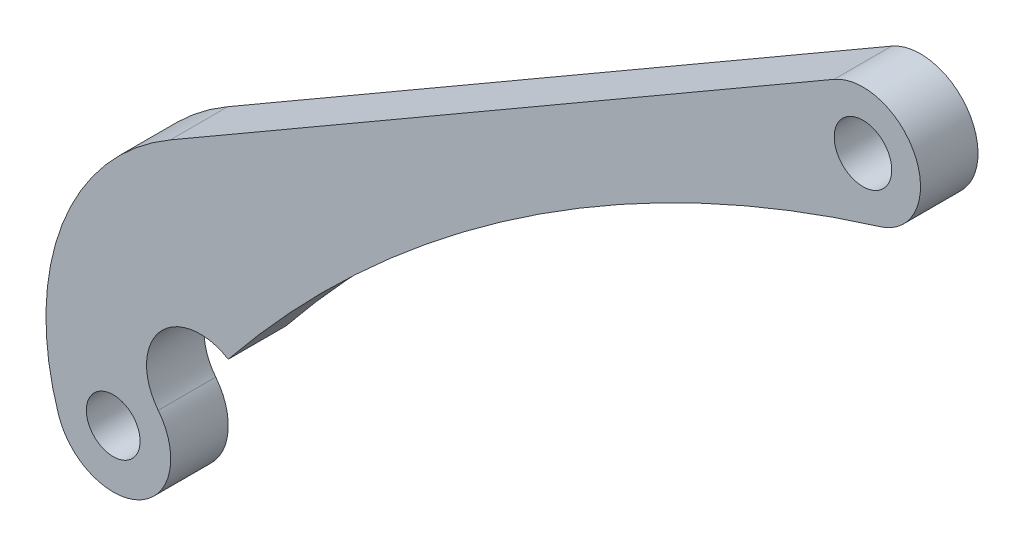
ISO-10303-21;
HEADER;
FILE_DESCRIPTION(('STEP AP214'),'2;1');
FILE_NAME('part.step','',(''),(''),'','','');
FILE_SCHEMA(('AUTOMOTIVE_DESIGN { 1 0 10303 214 1 1 1 1 }'));
ENDSEC;
DATA;
#1=APPLICATION_CONTEXT('core data for automotive mechanical design processes');
#2=APPLICATION_PROTOCOL_DEFINITION('international standard','automotive_design',2000,#1);
#3=PRODUCT_CONTEXT('',#1,'mechanical');
#4=PRODUCT('Part','Part','',(#3));
#5=PRODUCT_RELATED_PRODUCT_CATEGORY('part','',(#4));
#6=PRODUCT_DEFINITION_FORMATION('','',#4);
#7=PRODUCT_DEFINITION_CONTEXT('part definition',#1,'design');
#8=PRODUCT_DEFINITION('design','',#6,#7);
#9=PRODUCT_DEFINITION_SHAPE('','',#8);
#10=(LENGTH_UNIT() NAMED_UNIT(*) SI_UNIT(.MILLI.,.METRE.));
#11=(NAMED_UNIT(*) PLANE_ANGLE_UNIT() SI_UNIT($,.RADIAN.));
#12=(NAMED_UNIT(*) SI_UNIT($,.STERADIAN.) SOLID_ANGLE_UNIT());
#13=UNCERTAINTY_MEASURE_WITH_UNIT(LENGTH_MEASURE(1.E-05),#10,'distance_accuracy_value','');
#14=(GEOMETRIC_REPRESENTATION_CONTEXT(3) GLOBAL_UNCERTAINTY_ASSIGNED_CONTEXT((#13)) GLOBAL_UNIT_ASSIGNED_CONTEXT((#10,
#11,#12)) REPRESENTATION_CONTEXT('',''));
#15=CARTESIAN_POINT('',(0.,0.,0.));
#16=DIRECTION('',(0.,0.,1.));
#17=DIRECTION('',(1.,0.,0.));
#18=AXIS2_PLACEMENT_3D('',#15,#16,#17);
#19=CARTESIAN_POINT('',(-66.3099676028184,240.059967602818,7.5));
#20=DIRECTION('',(0.,0.,-1.));
#21=DIRECTION('',(-1.,0.,0.));
#22=AXIS2_PLACEMENT_3D('',#19,#20,#21);
#23=PLANE('',#22);
#24=CARTESIAN_POINT('',(-66.3099676028184,240.059967602818,7.5));
#25=DIRECTION('',(0.,0.,-1.));
#26=DIRECTION('',(-1.,0.,0.));
#27=AXIS2_PLACEMENT_3D('',#24,#25,#26);
#28=CIRCLE('',#27,14.);
#29=CARTESIAN_POINT('',(-77.2637763462854,231.341362553182,7.5));
#30=VERTEX_POINT('',#29);
#31=CARTESIAN_POINT('',(-59.,252.,7.5));
#32=VERTEX_POINT('',#31);
#33=EDGE_CURVE('E135',#30,#32,#28,.T.);
#34=ORIENTED_EDGE('',*,*,#33,.T.);
#35=CARTESIAN_POINT('',(213.405086368704,32.2376990463132,7.5));
#36=DIRECTION('',(0.,0.,-1.));
#37=DIRECTION('',(-1.,0.,0.));
#38=AXIS2_PLACEMENT_3D('',#35,#36,#37);
#39=CIRCLE('',#38,350.);
#40=CARTESIAN_POINT('',(110.433237586368,366.74748718165,7.5));
#41=VERTEX_POINT('',#40);
#42=EDGE_CURVE('E93',#32,#41,#39,.T.);
#43=ORIENTED_EDGE('',*,*,#42,.T.);
#44=CARTESIAN_POINT('',(106.485443860573,381.218662831837,7.5));
#45=DIRECTION('',(0.,0.,1.));
#46=DIRECTION('',(-1.,0.,0.));
#47=AXIS2_PLACEMENT_3D('',#44,#45,#46);
#48=CIRCLE('',#47,15.);
#49=CARTESIAN_POINT('',(98.9690926695505,394.199589793083,7.5));
#50=VERTEX_POINT('',#49);
#51=EDGE_CURVE('E106',#41,#50,#48,.T.);
#52=ORIENTED_EDGE('',*,*,#51,.T.);
#53=DIRECTION('',(-0.865395130749759,-0.501090079401506,0.));
#54=VECTOR('',#53,1.);
#55=CARTESIAN_POINT('',(-74.1099334804013,293.981573912782,7.5));
#56=LINE('',#55,#54);
#57=CARTESIAN_POINT('',(-74.1099334804012,293.981573912782,7.5));
#58=VERTEX_POINT('',#57);
#59=EDGE_CURVE('E100',#50,#58,#56,.T.);
#60=ORIENTED_EDGE('',*,*,#59,.T.);
#61=CARTESIAN_POINT('',(-41.5390783193033,237.730890414048,7.5));
#62=DIRECTION('',(0.,0.,1.));
#63=DIRECTION('',(-1.,0.,0.));
#64=AXIS2_PLACEMENT_3D('',#61,#62,#63);
#65=CIRCLE('',#64,65.);
#66=CARTESIAN_POINT('',(-103.238276504209,217.280732875786,7.5));
#67=VERTEX_POINT('',#66);
#68=EDGE_CURVE('E104',#58,#67,#65,.T.);
#69=ORIENTED_EDGE('',*,*,#68,.T.);
#70=CARTESIAN_POINT('',(-89.,222.,7.5));
#71=DIRECTION('',(0.,0.,1.));
#72=DIRECTION('',(1.,0.,0.));
#73=AXIS2_PLACEMENT_3D('',#70,#71,#72);
#74=CIRCLE('',#73,15.);
#75=EDGE_CURVE('E56',#67,#30,#74,.T.);
#76=ORIENTED_EDGE('',*,*,#75,.T.);
#77=EDGE_LOOP('',(#34,#43,#52,#60,#69,#76));
#78=FACE_BOUND('',#77,.T.);
#79=CARTESIAN_POINT('',(-89.,222.,7.5));
#80=DIRECTION('',(0.,0.,1.));
#81=DIRECTION('',(1.,0.,0.));
#82=AXIS2_PLACEMENT_3D('',#79,#80,#81);
#83=CIRCLE('',#82,7.);
#84=CARTESIAN_POINT('',(-82.,222.,7.5));
#85=VERTEX_POINT('',#84);
#86=EDGE_CURVE('E128',#85,#85,#83,.T.);
#87=ORIENTED_EDGE('',*,*,#86,.F.);
#88=EDGE_LOOP('',(#87));
#89=FACE_BOUND('',#88,.T.);
#90=CARTESIAN_POINT('',(106.485443860573,381.218662831837,7.5));
#91=DIRECTION('',(0.,0.,1.));
#92=DIRECTION('',(1.,0.,0.));
#93=AXIS2_PLACEMENT_3D('',#90,#91,#92);
#94=CIRCLE('',#93,7.50000000000001);
#95=CARTESIAN_POINT('',(113.985443860573,381.218662831837,7.5));
#96=VERTEX_POINT('',#95);
#97=EDGE_CURVE('E179',#96,#96,#94,.T.);
#98=ORIENTED_EDGE('',*,*,#97,.F.);
#99=EDGE_LOOP('',(#98));
#100=FACE_BOUND('',#99,.T.);
#101=ADVANCED_FACE('F39',(#78,#89,#100),#23,.F.);
#102=CARTESIAN_POINT('',(-66.3099676028184,240.059967602818,-7.5));
#103=DIRECTION('',(0.,0.,-1.));
#104=DIRECTION('',(-1.,0.,0.));
#105=AXIS2_PLACEMENT_3D('',#102,#103,#104);
#106=PLANE('',#105);
#107=CARTESIAN_POINT('',(-89.,222.,-7.5));
#108=DIRECTION('',(0.,0.,1.));
#109=DIRECTION('',(1.,0.,0.));
#110=AXIS2_PLACEMENT_3D('',#107,#108,#109);
#111=CIRCLE('',#110,7.);
#112=CARTESIAN_POINT('',(-82.,222.,-7.5));
#113=VERTEX_POINT('',#112);
#114=EDGE_CURVE('E184',#113,#113,#111,.T.);
#115=ORIENTED_EDGE('',*,*,#114,.T.);
#116=EDGE_LOOP('',(#115));
#117=FACE_BOUND('',#116,.T.);
#118=CARTESIAN_POINT('',(-66.3099676028184,240.059967602818,-7.5));
#119=DIRECTION('',(0.,0.,-1.));
#120=DIRECTION('',(-1.,0.,0.));
#121=AXIS2_PLACEMENT_3D('',#118,#119,#120);
#122=CIRCLE('',#121,14.);
#123=CARTESIAN_POINT('',(-77.2637763462854,231.341362553182,-7.5));
#124=VERTEX_POINT('',#123);
#125=CARTESIAN_POINT('',(-59.,252.,-7.5));
#126=VERTEX_POINT('',#125);
#127=EDGE_CURVE('E124',#124,#126,#122,.T.);
#128=ORIENTED_EDGE('',*,*,#127,.F.);
#129=CARTESIAN_POINT('',(-89.,222.,-7.5));
#130=DIRECTION('',(0.,0.,1.));
#131=DIRECTION('',(1.,0.,0.));
#132=AXIS2_PLACEMENT_3D('',#129,#130,#131);
#133=CIRCLE('',#132,15.);
#134=CARTESIAN_POINT('',(-103.238276504209,217.280732875786,-7.5));
#135=VERTEX_POINT('',#134);
#136=EDGE_CURVE('E85',#135,#124,#133,.T.);
#137=ORIENTED_EDGE('',*,*,#136,.F.);
#138=CARTESIAN_POINT('',(-41.5390783193033,237.730890414048,-7.5));
#139=DIRECTION('',(0.,0.,1.));
#140=DIRECTION('',(-1.,0.,0.));
#141=AXIS2_PLACEMENT_3D('',#138,#139,#140);
#142=CIRCLE('',#141,65.);
#143=CARTESIAN_POINT('',(-74.1099334804012,293.981573912782,-7.5));
#144=VERTEX_POINT('',#143);
#145=EDGE_CURVE('E79',#144,#135,#142,.T.);
#146=ORIENTED_EDGE('',*,*,#145,.F.);
#147=DIRECTION('',(-0.865395130749759,-0.501090079401506,0.));
#148=VECTOR('',#147,1.);
#149=CARTESIAN_POINT('',(-74.1099334804013,293.981573912782,-7.5));
#150=LINE('',#149,#148);
#151=CARTESIAN_POINT('',(98.9690926695505,394.199589793083,-7.5));
#152=VERTEX_POINT('',#151);
#153=EDGE_CURVE('E114',#152,#144,#150,.T.);
#154=ORIENTED_EDGE('',*,*,#153,.F.);
#155=CARTESIAN_POINT('',(106.485443860573,381.218662831837,-7.5));
#156=DIRECTION('',(0.,0.,1.));
#157=DIRECTION('',(-1.,0.,0.));
#158=AXIS2_PLACEMENT_3D('',#155,#156,#157);
#159=CIRCLE('',#158,15.);
#160=CARTESIAN_POINT('',(110.433237586368,366.74748718165,-7.5));
#161=VERTEX_POINT('',#160);
#162=EDGE_CURVE('E130',#161,#152,#159,.T.);
#163=ORIENTED_EDGE('',*,*,#162,.F.);
#164=CARTESIAN_POINT('',(213.405086368704,32.2376990463132,-7.5));
#165=DIRECTION('',(0.,0.,-1.));
#166=DIRECTION('',(-1.,0.,0.));
#167=AXIS2_PLACEMENT_3D('',#164,#165,#166);
#168=CIRCLE('',#167,350.);
#169=EDGE_CURVE('E127',#126,#161,#168,.T.);
#170=ORIENTED_EDGE('',*,*,#169,.F.);
#171=EDGE_LOOP('',(#128,#137,#146,#154,#163,#170));
#172=FACE_BOUND('',#171,.T.);
#173=CARTESIAN_POINT('',(106.485443860573,381.218662831837,-7.5));
#174=DIRECTION('',(0.,0.,1.));
#175=DIRECTION('',(1.,0.,0.));
#176=AXIS2_PLACEMENT_3D('',#173,#174,#175);
#177=CIRCLE('',#176,7.50000000000001);
#178=CARTESIAN_POINT('',(113.985443860573,381.218662831837,-7.5));
#179=VERTEX_POINT('',#178);
#180=EDGE_CURVE('E182',#179,#179,#177,.T.);
#181=ORIENTED_EDGE('',*,*,#180,.T.);
#182=EDGE_LOOP('',(#181));
#183=FACE_BOUND('',#182,.T.);
#184=ADVANCED_FACE('F144',(#117,#172,#183),#106,.T.);
#185=CARTESIAN_POINT('',(-66.3099676028184,240.059967602818,7.5));
#186=DIRECTION('',(0.,0.,-1.));
#187=DIRECTION('',(-1.,0.,0.));
#188=AXIS2_PLACEMENT_3D('',#185,#186,#187);
#189=CYLINDRICAL_SURFACE('',#188,14.);
#190=ORIENTED_EDGE('',*,*,#127,.T.);
#191=DIRECTION('',(0.,0.,-1.));
#192=VECTOR('',#191,1.);
#193=CARTESIAN_POINT('',(-59.,252.,7.5));
#194=LINE('',#193,#192);
#195=EDGE_CURVE('E11',#32,#126,#194,.T.);
#196=ORIENTED_EDGE('',*,*,#195,.F.);
#197=ORIENTED_EDGE('',*,*,#33,.F.);
#198=DIRECTION('',(0.,0.,-1.));
#199=VECTOR('',#198,1.);
#200=CARTESIAN_POINT('',(-77.2637763462854,231.341362553182,7.5));
#201=LINE('',#200,#199);
#202=EDGE_CURVE('E120',#30,#124,#201,.T.);
#203=ORIENTED_EDGE('',*,*,#202,.T.);
#204=EDGE_LOOP('',(#190,#196,#197,#203));
#205=FACE_BOUND('',#204,.T.);
#206=ADVANCED_FACE('F41',(#205),#189,.F.);
#207=CARTESIAN_POINT('',(213.405086368704,32.2376990463132,7.5));
#208=DIRECTION('',(0.,0.,-1.));
#209=DIRECTION('',(-1.,0.,0.));
#210=AXIS2_PLACEMENT_3D('',#207,#208,#209);
#211=CYLINDRICAL_SURFACE('',#210,350.);
#212=ORIENTED_EDGE('',*,*,#169,.T.);
#213=DIRECTION('',(0.,0.,-1.));
#214=VECTOR('',#213,1.);
#215=CARTESIAN_POINT('',(110.433237586368,366.74748718165,7.5));
#216=LINE('',#215,#214);
#217=EDGE_CURVE('E48',#41,#161,#216,.T.);
#218=ORIENTED_EDGE('',*,*,#217,.F.);
#219=ORIENTED_EDGE('',*,*,#42,.F.);
#220=ORIENTED_EDGE('',*,*,#195,.T.);
#221=EDGE_LOOP('',(#212,#218,#219,#220));
#222=FACE_BOUND('',#221,.T.);
#223=ADVANCED_FACE('F228',(#222),#211,.F.);
#224=CARTESIAN_POINT('',(106.485443860573,381.218662831837,7.5));
#225=DIRECTION('',(0.,0.,-1.));
#226=DIRECTION('',(-1.,0.,0.));
#227=AXIS2_PLACEMENT_3D('',#224,#225,#226);
#228=CYLINDRICAL_SURFACE('',#227,15.);
#229=ORIENTED_EDGE('',*,*,#162,.T.);
#230=DIRECTION('',(0.,0.,-1.));
#231=VECTOR('',#230,1.);
#232=CARTESIAN_POINT('',(98.9690926695505,394.199589793083,7.5));
#233=LINE('',#232,#231);
#234=EDGE_CURVE('E115',#50,#152,#233,.T.);
#235=ORIENTED_EDGE('',*,*,#234,.F.);
#236=ORIENTED_EDGE('',*,*,#51,.F.);
#237=ORIENTED_EDGE('',*,*,#217,.T.);
#238=EDGE_LOOP('',(#229,#235,#236,#237));
#239=FACE_BOUND('',#238,.T.);
#240=ADVANCED_FACE('F141',(#239),#228,.T.);
#241=CARTESIAN_POINT('',(-74.1099334804013,293.981573912782,7.5));
#242=DIRECTION('',(0.501090079401506,-0.865395130749759,0.));
#243=DIRECTION('',(0.865395130749759,0.501090079401506,0.));
#244=AXIS2_PLACEMENT_3D('',#241,#242,#243);
#245=PLANE('',#244);
#246=ORIENTED_EDGE('',*,*,#153,.T.);
#247=DIRECTION('',(0.,0.,-1.));
#248=VECTOR('',#247,1.);
#249=CARTESIAN_POINT('',(-74.1099334804012,293.981573912782,7.5));
#250=LINE('',#249,#248);
#251=EDGE_CURVE('E111',#58,#144,#250,.T.);
#252=ORIENTED_EDGE('',*,*,#251,.F.);
#253=ORIENTED_EDGE('',*,*,#59,.F.);
#254=ORIENTED_EDGE('',*,*,#234,.T.);
#255=EDGE_LOOP('',(#246,#252,#253,#254));
#256=FACE_BOUND('',#255,.T.);
#257=ADVANCED_FACE('F112',(#256),#245,.F.);
#258=CARTESIAN_POINT('',(-41.5390783193033,237.730890414048,7.5));
#259=DIRECTION('',(0.,0.,-1.));
#260=DIRECTION('',(-1.,0.,0.));
#261=AXIS2_PLACEMENT_3D('',#258,#259,#260);
#262=CYLINDRICAL_SURFACE('',#261,65.);
#263=ORIENTED_EDGE('',*,*,#145,.T.);
#264=DIRECTION('',(0.,0.,-1.));
#265=VECTOR('',#264,1.);
#266=CARTESIAN_POINT('',(-103.238276504209,217.280732875786,7.5));
#267=LINE('',#266,#265);
#268=EDGE_CURVE('E116',#67,#135,#267,.T.);
#269=ORIENTED_EDGE('',*,*,#268,.F.);
#270=ORIENTED_EDGE('',*,*,#68,.F.);
#271=ORIENTED_EDGE('',*,*,#251,.T.);
#272=EDGE_LOOP('',(#263,#269,#270,#271));
#273=FACE_BOUND('',#272,.T.);
#274=ADVANCED_FACE('F118',(#273),#262,.T.);
#275=CARTESIAN_POINT('',(-89.,222.,7.5));
#276=DIRECTION('',(0.,0.,-1.));
#277=DIRECTION('',(-1.,0.,0.));
#278=AXIS2_PLACEMENT_3D('',#275,#276,#277);
#279=CYLINDRICAL_SURFACE('',#278,15.);
#280=ORIENTED_EDGE('',*,*,#136,.T.);
#281=ORIENTED_EDGE('',*,*,#202,.F.);
#282=ORIENTED_EDGE('',*,*,#75,.F.);
#283=ORIENTED_EDGE('',*,*,#268,.T.);
#284=EDGE_LOOP('',(#280,#281,#282,#283));
#285=FACE_BOUND('',#284,.T.);
#286=ADVANCED_FACE('F149',(#285),#279,.T.);
#287=CARTESIAN_POINT('',(-89.,222.,7.5));
#288=DIRECTION('',(0.,0.,-1.));
#289=DIRECTION('',(-1.,0.,0.));
#290=AXIS2_PLACEMENT_3D('',#287,#288,#289);
#291=CYLINDRICAL_SURFACE('',#290,7.);
#292=ORIENTED_EDGE('',*,*,#86,.T.);
#293=EDGE_LOOP('',(#292));
#294=FACE_BOUND('',#293,.T.);
#295=ORIENTED_EDGE('',*,*,#114,.F.);
#296=EDGE_LOOP('',(#295));
#297=FACE_BOUND('',#296,.T.);
#298=ADVANCED_FACE('F151',(#294,#297),#291,.F.);
#299=CARTESIAN_POINT('',(106.485443860573,381.218662831837,7.5));
#300=DIRECTION('',(0.,0.,-1.));
#301=DIRECTION('',(-1.,0.,0.));
#302=AXIS2_PLACEMENT_3D('',#299,#300,#301);
#303=CYLINDRICAL_SURFACE('',#302,7.50000000000001);
#304=ORIENTED_EDGE('',*,*,#97,.T.);
#305=EDGE_LOOP('',(#304));
#306=FACE_BOUND('',#305,.T.);
#307=ORIENTED_EDGE('',*,*,#180,.F.);
#308=EDGE_LOOP('',(#307));
#309=FACE_BOUND('',#308,.T.);
#310=ADVANCED_FACE('F158',(#306,#309),#303,.F.);
#311=CLOSED_SHELL('',(#101,#184,#206,#223,#240,#257,#274,#286,#298,#310));
#312=MANIFOLD_SOLID_BREP('B2',#311);
#313=ADVANCED_BREP_SHAPE_REPRESENTATION('',(#18,#312),#14);
#314=SHAPE_DEFINITION_REPRESENTATION(#9,#313);
ENDSEC;
END-ISO-10303-21;
